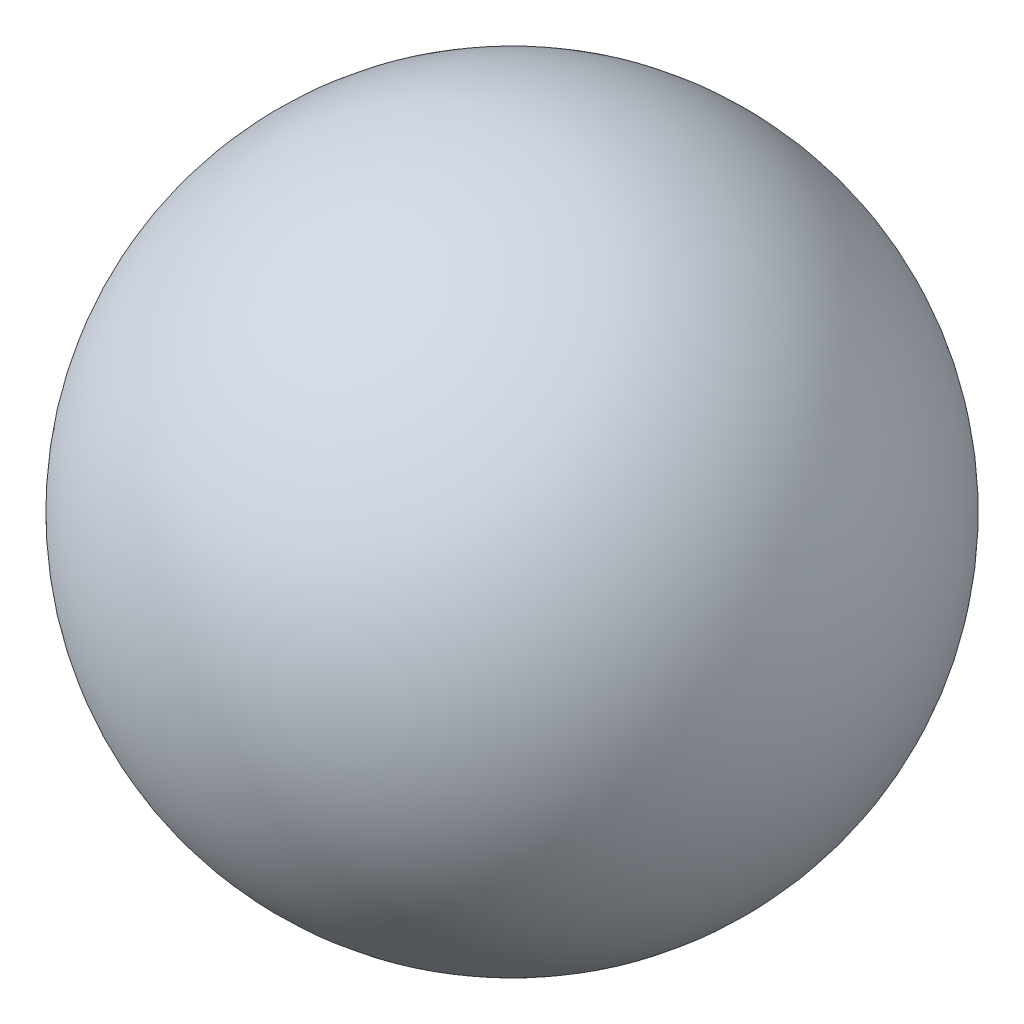
ISO-10303-21;
HEADER;
FILE_DESCRIPTION(('STEP AP214'),'2;1');
FILE_NAME('part.step','',(''),(''),'','','');
FILE_SCHEMA(('AUTOMOTIVE_DESIGN { 1 0 10303 214 1 1 1 1 }'));
ENDSEC;
DATA;
#1=APPLICATION_CONTEXT('core data for automotive mechanical design processes');
#2=APPLICATION_PROTOCOL_DEFINITION('international standard','automotive_design',2000,#1);
#3=PRODUCT_CONTEXT('',#1,'mechanical');
#4=PRODUCT('Part','Part','',(#3));
#5=PRODUCT_RELATED_PRODUCT_CATEGORY('part','',(#4));
#6=PRODUCT_DEFINITION_FORMATION('','',#4);
#7=PRODUCT_DEFINITION_CONTEXT('part definition',#1,'design');
#8=PRODUCT_DEFINITION('design','',#6,#7);
#9=PRODUCT_DEFINITION_SHAPE('','',#8);
#10=(LENGTH_UNIT() NAMED_UNIT(*) SI_UNIT(.MILLI.,.METRE.));
#11=(NAMED_UNIT(*) PLANE_ANGLE_UNIT() SI_UNIT($,.RADIAN.));
#12=(NAMED_UNIT(*) SI_UNIT($,.STERADIAN.) SOLID_ANGLE_UNIT());
#13=UNCERTAINTY_MEASURE_WITH_UNIT(LENGTH_MEASURE(1.E-05),#10,'distance_accuracy_value','');
#14=(GEOMETRIC_REPRESENTATION_CONTEXT(3) GLOBAL_UNCERTAINTY_ASSIGNED_CONTEXT((#13)) GLOBAL_UNIT_ASSIGNED_CONTEXT((#10,
#11,#12)) REPRESENTATION_CONTEXT('',''));
#15=CARTESIAN_POINT('',(0.,0.,0.));
#16=DIRECTION('',(0.,0.,1.));
#17=DIRECTION('',(1.,0.,0.));
#18=AXIS2_PLACEMENT_3D('',#15,#16,#17);
#19=CARTESIAN_POINT('',(0.,20.,0.));
#20=DIRECTION('',(0.,1.,0.));
#21=DIRECTION('',(-1.,0.,0.));
#22=AXIS2_PLACEMENT_3D('',#19,#20,#21);
#23=SPHERICAL_SURFACE('',#22,20.);
#24=CARTESIAN_POINT('',(0.,40.,0.));
#25=VERTEX_POINT('',#24);
#26=VERTEX_LOOP('',#25);
#27=FACE_BOUND('',#26,.T.);
#28=ADVANCED_FACE('F42',(#27),#23,.T.);
#29=CLOSED_SHELL('',(#28));
#30=CARTESIAN_POINT('',(0.,20.,0.));
#31=DIRECTION('',(0.,1.,0.));
#32=DIRECTION('',(1.,0.,0.));
#33=AXIS2_PLACEMENT_3D('',#30,#31,#32);
#34=SPHERICAL_SURFACE('',#33,19.458);
#35=CARTESIAN_POINT('',(0.,39.458,0.));
#36=VERTEX_POINT('',#35);
#37=VERTEX_LOOP('',#36);
#38=FACE_BOUND('',#37,.T.);
#39=ADVANCED_FACE('F56',(#38),#34,.F.);
#40=CLOSED_SHELL('',(#39));
#41=ORIENTED_CLOSED_SHELL('',*,#40,.T.);
#42=BREP_WITH_VOIDS('B2',#29,(#41));
#43=ADVANCED_BREP_SHAPE_REPRESENTATION('',(#18,#42),#14);
#44=SHAPE_DEFINITION_REPRESENTATION(#9,#43);
ENDSEC;
END-ISO-10303-21;
